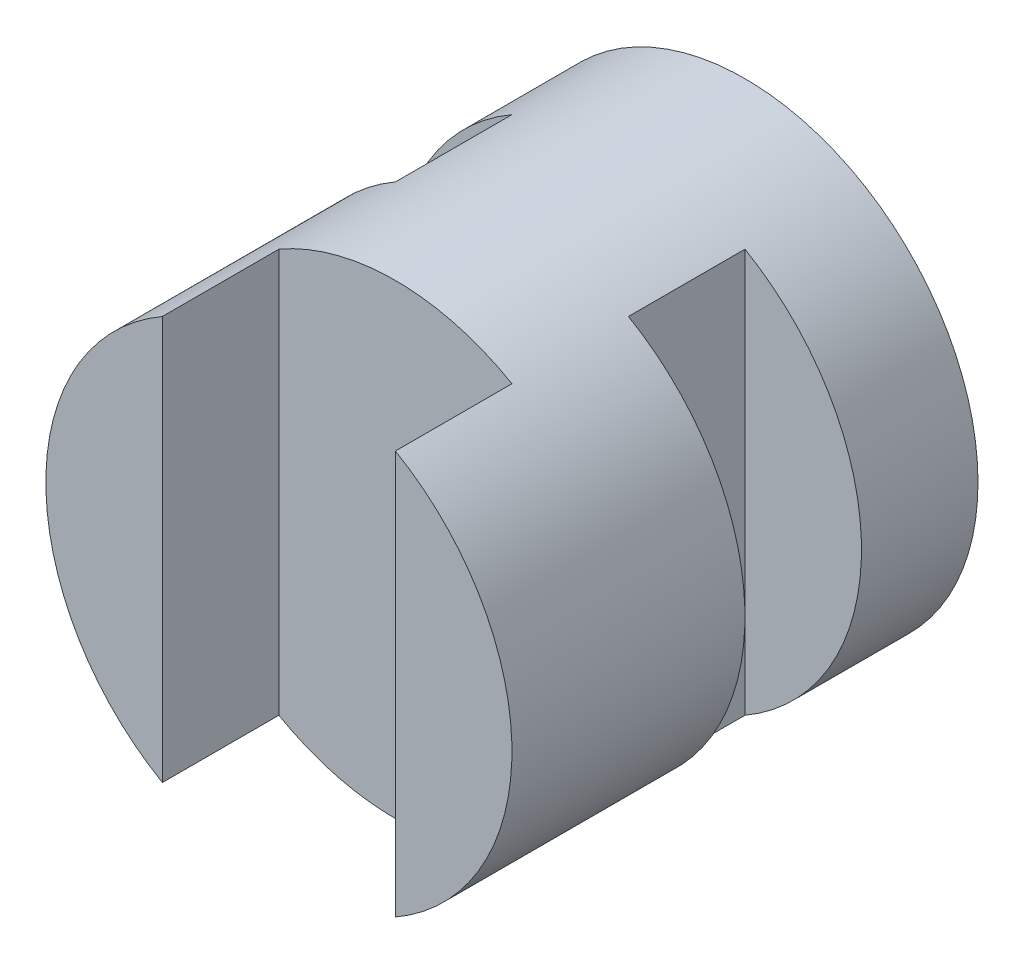
ISO-10303-21;
HEADER;
FILE_DESCRIPTION(('STEP AP214'),'2;1');
FILE_NAME('part.step','',(''),(''),'','','');
FILE_SCHEMA(('AUTOMOTIVE_DESIGN { 1 0 10303 214 1 1 1 1 }'));
ENDSEC;
DATA;
#1=APPLICATION_CONTEXT('core data for automotive mechanical design processes');
#2=APPLICATION_PROTOCOL_DEFINITION('international standard','automotive_design',2000,#1);
#3=PRODUCT_CONTEXT('',#1,'mechanical');
#4=PRODUCT('Part','Part','',(#3));
#5=PRODUCT_RELATED_PRODUCT_CATEGORY('part','',(#4));
#6=PRODUCT_DEFINITION_FORMATION('','',#4);
#7=PRODUCT_DEFINITION_CONTEXT('part definition',#1,'design');
#8=PRODUCT_DEFINITION('design','',#6,#7);
#9=PRODUCT_DEFINITION_SHAPE('','',#8);
#10=(LENGTH_UNIT() NAMED_UNIT(*) SI_UNIT(.MILLI.,.METRE.));
#11=(NAMED_UNIT(*) PLANE_ANGLE_UNIT() SI_UNIT($,.RADIAN.));
#12=(NAMED_UNIT(*) SI_UNIT($,.STERADIAN.) SOLID_ANGLE_UNIT());
#13=UNCERTAINTY_MEASURE_WITH_UNIT(LENGTH_MEASURE(1.E-05),#10,'distance_accuracy_value','');
#14=(GEOMETRIC_REPRESENTATION_CONTEXT(3) GLOBAL_UNCERTAINTY_ASSIGNED_CONTEXT((#13)) GLOBAL_UNIT_ASSIGNED_CONTEXT((#10,
#11,#12)) REPRESENTATION_CONTEXT('',''));
#15=CARTESIAN_POINT('',(0.,0.,0.));
#16=DIRECTION('',(0.,0.,1.));
#17=DIRECTION('',(1.,0.,0.));
#18=AXIS2_PLACEMENT_3D('',#15,#16,#17);
#19=CARTESIAN_POINT('',(0.,0.,4.));
#20=DIRECTION('',(0.,0.,1.));
#21=DIRECTION('',(1.,0.,0.));
#22=AXIS2_PLACEMENT_3D('',#19,#20,#21);
#23=PLANE('',#22);
#24=DIRECTION('',(0.,-1.,0.));
#25=VECTOR('',#24,1.);
#26=CARTESIAN_POINT('',(-1.,0.,4.));
#27=LINE('',#26,#25);
#28=CARTESIAN_POINT('',(-1.,1.73205080756888,4.));
#29=VERTEX_POINT('',#28);
#30=CARTESIAN_POINT('',(-1.,-1.73205080756888,4.));
#31=VERTEX_POINT('',#30);
#32=EDGE_CURVE('E104',#29,#31,#27,.T.);
#33=ORIENTED_EDGE('',*,*,#32,.F.);
#34=CARTESIAN_POINT('',(0.,0.,4.));
#35=DIRECTION('',(0.,0.,1.));
#36=DIRECTION('',(1.,0.,0.));
#37=AXIS2_PLACEMENT_3D('',#34,#35,#36);
#38=CIRCLE('',#37,2.);
#39=EDGE_CURVE('E105',#29,#31,#38,.T.);
#40=ORIENTED_EDGE('',*,*,#39,.T.);
#41=EDGE_LOOP('',(#33,#40));
#42=FACE_BOUND('',#41,.T.);
#43=ADVANCED_FACE('F33',(#42),#23,.T.);
#44=CARTESIAN_POINT('',(0.,0.,4.));
#45=DIRECTION('',(0.,0.,-1.));
#46=DIRECTION('',(-1.,0.,0.));
#47=AXIS2_PLACEMENT_3D('',#44,#45,#46);
#48=CYLINDRICAL_SURFACE('',#47,2.);
#49=DIRECTION('',(0.,0.,-1.));
#50=VECTOR('',#49,1.);
#51=CARTESIAN_POINT('',(1.,1.73205080756888,4.));
#52=LINE('',#51,#50);
#53=CARTESIAN_POINT('',(1.,1.73205080756888,2.));
#54=VERTEX_POINT('',#53);
#55=CARTESIAN_POINT('',(1.,1.73205080756888,1.));
#56=VERTEX_POINT('',#55);
#57=EDGE_CURVE('E141',#54,#56,#52,.T.);
#58=ORIENTED_EDGE('',*,*,#57,.T.);
#59=CARTESIAN_POINT('',(0.,0.,1.));
#60=DIRECTION('',(0.,0.,-1.));
#61=DIRECTION('',(-1.,0.,0.));
#62=AXIS2_PLACEMENT_3D('',#59,#60,#61);
#63=CIRCLE('',#62,2.);
#64=CARTESIAN_POINT('',(1.,-1.73205080756888,1.));
#65=VERTEX_POINT('',#64);
#66=EDGE_CURVE('E143',#56,#65,#63,.T.);
#67=ORIENTED_EDGE('',*,*,#66,.T.);
#68=DIRECTION('',(0.,0.,-1.));
#69=VECTOR('',#68,1.);
#70=CARTESIAN_POINT('',(1.,-1.73205080756888,4.));
#71=LINE('',#70,#69);
#72=CARTESIAN_POINT('',(1.,-1.73205080756888,2.));
#73=VERTEX_POINT('',#72);
#74=EDGE_CURVE('E138',#65,#73,#71,.F.);
#75=ORIENTED_EDGE('',*,*,#74,.T.);
#76=CARTESIAN_POINT('',(0.,0.,2.));
#77=DIRECTION('',(0.,0.,1.));
#78=DIRECTION('',(1.,0.,0.));
#79=AXIS2_PLACEMENT_3D('',#76,#77,#78);
#80=CIRCLE('',#79,2.);
#81=EDGE_CURVE('E136',#73,#54,#80,.T.);
#82=ORIENTED_EDGE('',*,*,#81,.T.);
#83=EDGE_LOOP('',(#58,#67,#75,#82));
#84=FACE_BOUND('',#83,.T.);
#85=CARTESIAN_POINT('',(0.,0.,1.));
#86=DIRECTION('',(0.,0.,-1.));
#87=DIRECTION('',(-1.,0.,0.));
#88=AXIS2_PLACEMENT_3D('',#85,#86,#87);
#89=CIRCLE('',#88,2.);
#90=CARTESIAN_POINT('',(-1.,-1.73205080756888,1.));
#91=VERTEX_POINT('',#90);
#92=CARTESIAN_POINT('',(-1.,1.73205080756888,1.));
#93=VERTEX_POINT('',#92);
#94=EDGE_CURVE('E134',#91,#93,#89,.T.);
#95=ORIENTED_EDGE('',*,*,#94,.T.);
#96=DIRECTION('',(0.,0.,-1.));
#97=VECTOR('',#96,1.);
#98=CARTESIAN_POINT('',(-0.999999999999999,1.73205080756888,4.));
#99=LINE('',#98,#97);
#100=CARTESIAN_POINT('',(-1.,1.73205080756888,2.));
#101=VERTEX_POINT('',#100);
#102=EDGE_CURVE('E128',#93,#101,#99,.F.);
#103=ORIENTED_EDGE('',*,*,#102,.T.);
#104=CARTESIAN_POINT('',(0.,0.,2.));
#105=DIRECTION('',(0.,0.,1.));
#106=DIRECTION('',(1.,0.,0.));
#107=AXIS2_PLACEMENT_3D('',#104,#105,#106);
#108=CIRCLE('',#107,2.);
#109=CARTESIAN_POINT('',(-1.,-1.73205080756888,2.));
#110=VERTEX_POINT('',#109);
#111=EDGE_CURVE('E125',#101,#110,#108,.T.);
#112=ORIENTED_EDGE('',*,*,#111,.T.);
#113=DIRECTION('',(0.,0.,-1.));
#114=VECTOR('',#113,1.);
#115=CARTESIAN_POINT('',(-0.999999999999999,-1.73205080756888,4.));
#116=LINE('',#115,#114);
#117=EDGE_CURVE('E131',#110,#91,#116,.T.);
#118=ORIENTED_EDGE('',*,*,#117,.T.);
#119=EDGE_LOOP('',(#95,#103,#112,#118));
#120=FACE_BOUND('',#119,.T.);
#121=CARTESIAN_POINT('',(0.,0.,3.));
#122=DIRECTION('',(0.,0.,-1.));
#123=DIRECTION('',(-1.,0.,0.));
#124=AXIS2_PLACEMENT_3D('',#121,#122,#123);
#125=CIRCLE('',#124,2.);
#126=CARTESIAN_POINT('',(1.,-1.73205080756888,3.));
#127=VERTEX_POINT('',#126);
#128=CARTESIAN_POINT('',(-1.,-1.73205080756888,3.));
#129=VERTEX_POINT('',#128);
#130=EDGE_CURVE('E11',#127,#129,#125,.T.);
#131=ORIENTED_EDGE('',*,*,#130,.T.);
#132=DIRECTION('',(0.,0.,-1.));
#133=VECTOR('',#132,1.);
#134=CARTESIAN_POINT('',(-1.,-1.73205080756888,4.));
#135=LINE('',#134,#133);
#136=EDGE_CURVE('E169',#129,#31,#135,.F.);
#137=ORIENTED_EDGE('',*,*,#136,.T.);
#138=ORIENTED_EDGE('',*,*,#39,.F.);
#139=DIRECTION('',(0.,0.,-1.));
#140=VECTOR('',#139,1.);
#141=CARTESIAN_POINT('',(-1.,1.73205080756888,4.));
#142=LINE('',#141,#140);
#143=CARTESIAN_POINT('',(-1.,1.73205080756888,3.));
#144=VERTEX_POINT('',#143);
#145=EDGE_CURVE('E119',#29,#144,#142,.T.);
#146=ORIENTED_EDGE('',*,*,#145,.T.);
#147=CARTESIAN_POINT('',(1.,1.73205080756888,3.));
#148=VERTEX_POINT('',#147);
#149=EDGE_CURVE('E37',#144,#148,#125,.T.);
#150=ORIENTED_EDGE('',*,*,#149,.T.);
#151=DIRECTION('',(0.,0.,-1.));
#152=VECTOR('',#151,1.);
#153=CARTESIAN_POINT('',(1.,1.73205080756888,4.));
#154=LINE('',#153,#152);
#155=CARTESIAN_POINT('',(1.,1.73205080756888,4.));
#156=VERTEX_POINT('',#155);
#157=EDGE_CURVE('E99',#148,#156,#154,.F.);
#158=ORIENTED_EDGE('',*,*,#157,.T.);
#159=CARTESIAN_POINT('',(1.,-1.73205080756888,4.));
#160=VERTEX_POINT('',#159);
#161=EDGE_CURVE('E110',#160,#156,#38,.T.);
#162=ORIENTED_EDGE('',*,*,#161,.F.);
#163=DIRECTION('',(0.,0.,-1.));
#164=VECTOR('',#163,1.);
#165=CARTESIAN_POINT('',(1.,-1.73205080756888,4.));
#166=LINE('',#165,#164);
#167=EDGE_CURVE('E55',#160,#127,#166,.T.);
#168=ORIENTED_EDGE('',*,*,#167,.T.);
#169=EDGE_LOOP('',(#131,#137,#138,#146,#150,#158,#162,#168));
#170=FACE_BOUND('',#169,.T.);
#171=CARTESIAN_POINT('',(0.,0.,0.));
#172=DIRECTION('',(0.,0.,1.));
#173=DIRECTION('',(1.,0.,0.));
#174=AXIS2_PLACEMENT_3D('',#171,#172,#173);
#175=CIRCLE('',#174,2.);
#176=CARTESIAN_POINT('',(2.,0.,0.));
#177=VERTEX_POINT('',#176);
#178=EDGE_CURVE('E115',#177,#177,#175,.T.);
#179=ORIENTED_EDGE('',*,*,#178,.T.);
#180=EDGE_LOOP('',(#179));
#181=FACE_BOUND('',#180,.T.);
#182=ADVANCED_FACE('F35',(#84,#120,#170,#181),#48,.T.);
#183=DIRECTION('',(0.,1.,0.));
#184=VECTOR('',#183,1.);
#185=CARTESIAN_POINT('',(1.,0.,4.));
#186=LINE('',#185,#184);
#187=EDGE_CURVE('E96',#160,#156,#186,.T.);
#188=ORIENTED_EDGE('',*,*,#187,.F.);
#189=ORIENTED_EDGE('',*,*,#161,.T.);
#190=EDGE_LOOP('',(#188,#189));
#191=FACE_BOUND('',#190,.T.);
#192=ADVANCED_FACE('F114',(#191),#23,.T.);
#193=CARTESIAN_POINT('',(0.,0.,0.));
#194=DIRECTION('',(0.,0.,1.));
#195=DIRECTION('',(1.,0.,0.));
#196=AXIS2_PLACEMENT_3D('',#193,#194,#195);
#197=PLANE('',#196);
#198=ORIENTED_EDGE('',*,*,#178,.F.);
#199=EDGE_LOOP('',(#198));
#200=FACE_BOUND('',#199,.T.);
#201=ADVANCED_FACE('F185',(#200),#197,.F.);
#202=CARTESIAN_POINT('',(-1.,-5.,3.));
#203=DIRECTION('',(0.,0.,-1.));
#204=DIRECTION('',(-1.,0.,0.));
#205=AXIS2_PLACEMENT_3D('',#202,#203,#204);
#206=PLANE('',#205);
#207=DIRECTION('',(0.,1.,0.));
#208=VECTOR('',#207,1.);
#209=CARTESIAN_POINT('',(-1.,-5.,3.));
#210=LINE('',#209,#208);
#211=EDGE_CURVE('E160',#129,#144,#210,.T.);
#212=ORIENTED_EDGE('',*,*,#211,.F.);
#213=ORIENTED_EDGE('',*,*,#130,.F.);
#214=DIRECTION('',(0.,1.,0.));
#215=VECTOR('',#214,1.);
#216=CARTESIAN_POINT('',(1.,-5.,3.));
#217=LINE('',#216,#215);
#218=EDGE_CURVE('E165',#127,#148,#217,.T.);
#219=ORIENTED_EDGE('',*,*,#218,.T.);
#220=ORIENTED_EDGE('',*,*,#149,.F.);
#221=EDGE_LOOP('',(#212,#213,#219,#220));
#222=FACE_BOUND('',#221,.T.);
#223=ADVANCED_FACE('F190',(#222),#206,.F.);
#224=CARTESIAN_POINT('',(-1.,-5.,4.));
#225=DIRECTION('',(-1.,0.,0.));
#226=DIRECTION('',(0.,0.,1.));
#227=AXIS2_PLACEMENT_3D('',#224,#225,#226);
#228=PLANE('',#227);
#229=ORIENTED_EDGE('',*,*,#32,.T.);
#230=ORIENTED_EDGE('',*,*,#136,.F.);
#231=ORIENTED_EDGE('',*,*,#211,.T.);
#232=ORIENTED_EDGE('',*,*,#145,.F.);
#233=EDGE_LOOP('',(#229,#230,#231,#232));
#234=FACE_BOUND('',#233,.T.);
#235=ADVANCED_FACE('F174',(#234),#228,.F.);
#236=CARTESIAN_POINT('',(1.,-5.,4.));
#237=DIRECTION('',(1.,0.,0.));
#238=DIRECTION('',(0.,0.,-1.));
#239=AXIS2_PLACEMENT_3D('',#236,#237,#238);
#240=PLANE('',#239);
#241=ORIENTED_EDGE('',*,*,#187,.T.);
#242=ORIENTED_EDGE('',*,*,#157,.F.);
#243=ORIENTED_EDGE('',*,*,#218,.F.);
#244=ORIENTED_EDGE('',*,*,#167,.F.);
#245=EDGE_LOOP('',(#241,#242,#243,#244));
#246=FACE_BOUND('',#245,.T.);
#247=ADVANCED_FACE('F98',(#246),#240,.F.);
#248=CARTESIAN_POINT('',(-2.,-5.,1.));
#249=DIRECTION('',(0.,0.,-1.));
#250=DIRECTION('',(-1.,0.,0.));
#251=AXIS2_PLACEMENT_3D('',#248,#249,#250);
#252=PLANE('',#251);
#253=ORIENTED_EDGE('',*,*,#94,.F.);
#254=DIRECTION('',(0.,1.,0.));
#255=VECTOR('',#254,1.);
#256=CARTESIAN_POINT('',(-1.,-5.,1.));
#257=LINE('',#256,#255);
#258=EDGE_CURVE('E112',#91,#93,#257,.T.);
#259=ORIENTED_EDGE('',*,*,#258,.T.);
#260=EDGE_LOOP('',(#253,#259));
#261=FACE_BOUND('',#260,.T.);
#262=ADVANCED_FACE('F205',(#261),#252,.F.);
#263=CARTESIAN_POINT('',(-1.,-5.,1.));
#264=DIRECTION('',(1.,0.,0.));
#265=DIRECTION('',(0.,0.,-1.));
#266=AXIS2_PLACEMENT_3D('',#263,#264,#265);
#267=PLANE('',#266);
#268=DIRECTION('',(0.,1.,0.));
#269=VECTOR('',#268,1.);
#270=CARTESIAN_POINT('',(-1.,-5.,2.));
#271=LINE('',#270,#269);
#272=EDGE_CURVE('E47',#110,#101,#271,.T.);
#273=ORIENTED_EDGE('',*,*,#272,.T.);
#274=ORIENTED_EDGE('',*,*,#102,.F.);
#275=ORIENTED_EDGE('',*,*,#258,.F.);
#276=ORIENTED_EDGE('',*,*,#117,.F.);
#277=EDGE_LOOP('',(#273,#274,#275,#276));
#278=FACE_BOUND('',#277,.T.);
#279=ADVANCED_FACE('F209',(#278),#267,.F.);
#280=CARTESIAN_POINT('',(-2.,-5.,2.));
#281=DIRECTION('',(0.,0.,1.));
#282=DIRECTION('',(1.,0.,0.));
#283=AXIS2_PLACEMENT_3D('',#280,#281,#282);
#284=PLANE('',#283);
#285=ORIENTED_EDGE('',*,*,#272,.F.);
#286=ORIENTED_EDGE('',*,*,#111,.F.);
#287=EDGE_LOOP('',(#285,#286));
#288=FACE_BOUND('',#287,.T.);
#289=ADVANCED_FACE('F212',(#288),#284,.F.);
#290=CARTESIAN_POINT('',(1.,-5.,1.));
#291=DIRECTION('',(-1.,0.,0.));
#292=DIRECTION('',(0.,0.,1.));
#293=AXIS2_PLACEMENT_3D('',#290,#291,#292);
#294=PLANE('',#293);
#295=DIRECTION('',(0.,1.,0.));
#296=VECTOR('',#295,1.);
#297=CARTESIAN_POINT('',(1.,-5.,2.));
#298=LINE('',#297,#296);
#299=EDGE_CURVE('E157',#73,#54,#298,.T.);
#300=ORIENTED_EDGE('',*,*,#299,.F.);
#301=ORIENTED_EDGE('',*,*,#74,.F.);
#302=DIRECTION('',(0.,1.,0.));
#303=VECTOR('',#302,1.);
#304=CARTESIAN_POINT('',(1.,-5.,1.));
#305=LINE('',#304,#303);
#306=EDGE_CURVE('E152',#65,#56,#305,.T.);
#307=ORIENTED_EDGE('',*,*,#306,.T.);
#308=ORIENTED_EDGE('',*,*,#57,.F.);
#309=EDGE_LOOP('',(#300,#301,#307,#308));
#310=FACE_BOUND('',#309,.T.);
#311=ADVANCED_FACE('F155',(#310),#294,.F.);
#312=CARTESIAN_POINT('',(1.,-5.,1.));
#313=DIRECTION('',(0.,0.,-1.));
#314=DIRECTION('',(-1.,0.,0.));
#315=AXIS2_PLACEMENT_3D('',#312,#313,#314);
#316=PLANE('',#315);
#317=ORIENTED_EDGE('',*,*,#306,.F.);
#318=ORIENTED_EDGE('',*,*,#66,.F.);
#319=EDGE_LOOP('',(#317,#318));
#320=FACE_BOUND('',#319,.T.);
#321=ADVANCED_FACE('F151',(#320),#316,.F.);
#322=CARTESIAN_POINT('',(2.,-5.,2.));
#323=DIRECTION('',(0.,0.,1.));
#324=DIRECTION('',(1.,0.,0.));
#325=AXIS2_PLACEMENT_3D('',#322,#323,#324);
#326=PLANE('',#325);
#327=ORIENTED_EDGE('',*,*,#81,.F.);
#328=ORIENTED_EDGE('',*,*,#299,.T.);
#329=EDGE_LOOP('',(#327,#328));
#330=FACE_BOUND('',#329,.T.);
#331=ADVANCED_FACE('F221',(#330),#326,.F.);
#332=CLOSED_SHELL('',(#43,#182,#192,#201,#223,#235,#247,#262,#279,#289,#311,#321,#331));
#333=MANIFOLD_SOLID_BREP('B2',#332);
#334=ADVANCED_BREP_SHAPE_REPRESENTATION('',(#18,#333),#14);
#335=SHAPE_DEFINITION_REPRESENTATION(#9,#334);
ENDSEC;
END-ISO-10303-21;
